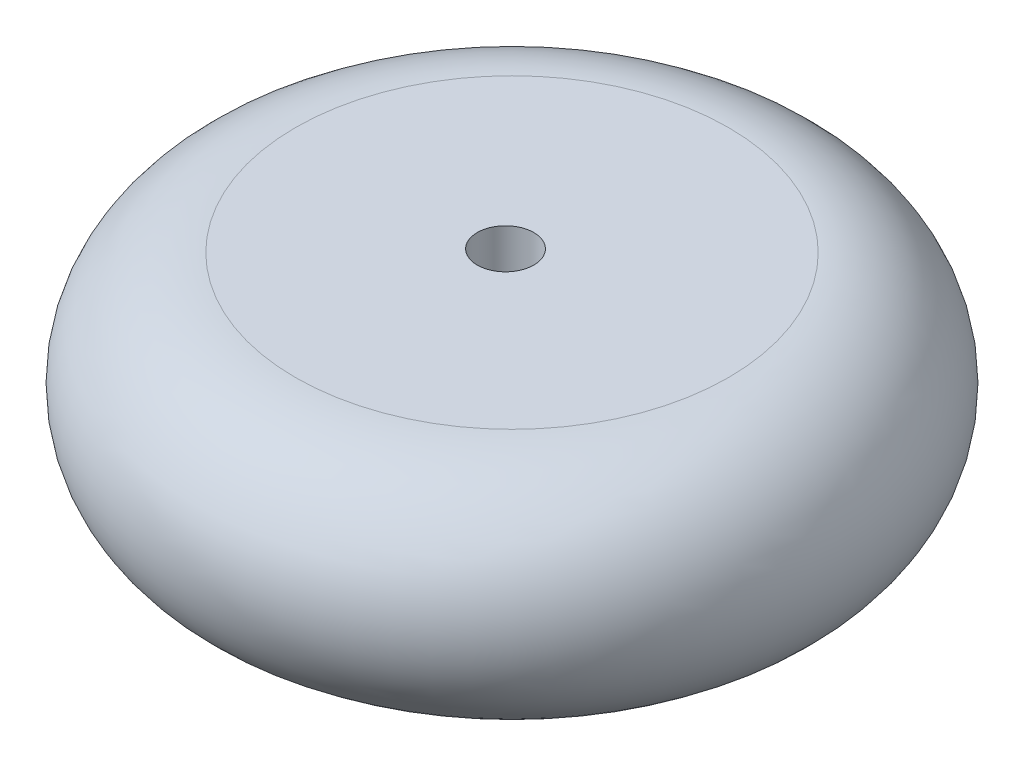
ISO-10303-21;
HEADER;
FILE_DESCRIPTION(('STEP AP214'),'2;1');
FILE_NAME('part.step','',(''),(''),'','','');
FILE_SCHEMA(('AUTOMOTIVE_DESIGN { 1 0 10303 214 1 1 1 1 }'));
ENDSEC;
DATA;
#1=APPLICATION_CONTEXT('core data for automotive mechanical design processes');
#2=APPLICATION_PROTOCOL_DEFINITION('international standard','automotive_design',2000,#1);
#3=PRODUCT_CONTEXT('',#1,'mechanical');
#4=PRODUCT('Part','Part','',(#3));
#5=PRODUCT_RELATED_PRODUCT_CATEGORY('part','',(#4));
#6=PRODUCT_DEFINITION_FORMATION('','',#4);
#7=PRODUCT_DEFINITION_CONTEXT('part definition',#1,'design');
#8=PRODUCT_DEFINITION('design','',#6,#7);
#9=PRODUCT_DEFINITION_SHAPE('','',#8);
#10=(LENGTH_UNIT() NAMED_UNIT(*) SI_UNIT(.MILLI.,.METRE.));
#11=(NAMED_UNIT(*) PLANE_ANGLE_UNIT() SI_UNIT($,.RADIAN.));
#12=(NAMED_UNIT(*) SI_UNIT($,.STERADIAN.) SOLID_ANGLE_UNIT());
#13=UNCERTAINTY_MEASURE_WITH_UNIT(LENGTH_MEASURE(1.E-05),#10,'distance_accuracy_value','');
#14=(GEOMETRIC_REPRESENTATION_CONTEXT(3) GLOBAL_UNCERTAINTY_ASSIGNED_CONTEXT((#13)) GLOBAL_UNIT_ASSIGNED_CONTEXT((#10,
#11,#12)) REPRESENTATION_CONTEXT('',''));
#15=CARTESIAN_POINT('',(0.,0.,0.));
#16=DIRECTION('',(0.,0.,1.));
#17=DIRECTION('',(1.,0.,0.));
#18=AXIS2_PLACEMENT_3D('',#15,#16,#17);
#19=CARTESIAN_POINT('',(13.,0.,0.));
#20=DIRECTION('',(0.,1.,0.));
#21=DIRECTION('',(-1.,0.,0.));
#22=AXIS2_PLACEMENT_3D('',#19,#20,#21);
#23=TOROIDAL_SURFACE('',#22,23.,12.);
#24=CARTESIAN_POINT('',(13.,-12.,0.));
#25=DIRECTION('',(0.,1.,0.));
#26=DIRECTION('',(-1.,0.,0.));
#27=AXIS2_PLACEMENT_3D('',#24,#25,#26);
#28=CIRCLE('',#27,23.);
#29=CARTESIAN_POINT('',(-10.,-12.,0.));
#30=VERTEX_POINT('',#29);
#31=EDGE_CURVE('E10',#30,#30,#28,.T.);
#32=ORIENTED_EDGE('',*,*,#31,.T.);
#33=EDGE_LOOP('',(#32));
#34=FACE_BOUND('',#33,.T.);
#35=CARTESIAN_POINT('',(13.,12.,0.));
#36=DIRECTION('',(0.,1.,0.));
#37=DIRECTION('',(-1.,0.,0.));
#38=AXIS2_PLACEMENT_3D('',#35,#36,#37);
#39=CIRCLE('',#38,23.);
#40=CARTESIAN_POINT('',(-10.,12.,0.));
#41=VERTEX_POINT('',#40);
#42=EDGE_CURVE('E40',#41,#41,#39,.T.);
#43=ORIENTED_EDGE('',*,*,#42,.F.);
#44=EDGE_LOOP('',(#43));
#45=FACE_BOUND('',#44,.T.);
#46=ADVANCED_FACE('F34',(#34,#45),#23,.T.);
#47=CARTESIAN_POINT('',(-10.,-12.,0.));
#48=DIRECTION('',(0.,-1.,0.));
#49=DIRECTION('',(1.,0.,0.));
#50=AXIS2_PLACEMENT_3D('',#47,#48,#49);
#51=PLANE('',#50);
#52=CARTESIAN_POINT('',(12.3108556447744,-12.,0.));
#53=DIRECTION('',(0.,-1.,0.));
#54=DIRECTION('',(1.,0.,0.));
#55=AXIS2_PLACEMENT_3D('',#52,#53,#54);
#56=CIRCLE('',#55,3.);
#57=CARTESIAN_POINT('',(15.3108556447744,-12.,0.));
#58=VERTEX_POINT('',#57);
#59=EDGE_CURVE('E44',#58,#58,#56,.T.);
#60=ORIENTED_EDGE('',*,*,#59,.F.);
#61=EDGE_LOOP('',(#60));
#62=FACE_BOUND('',#61,.T.);
#63=ORIENTED_EDGE('',*,*,#31,.F.);
#64=EDGE_LOOP('',(#63));
#65=FACE_BOUND('',#64,.T.);
#66=ADVANCED_FACE('F62',(#62,#65),#51,.T.);
#67=CARTESIAN_POINT('',(-10.,12.,0.));
#68=DIRECTION('',(0.,1.,0.));
#69=DIRECTION('',(-1.,0.,0.));
#70=AXIS2_PLACEMENT_3D('',#67,#68,#69);
#71=PLANE('',#70);
#72=CARTESIAN_POINT('',(12.3108556447744,12.,0.));
#73=DIRECTION('',(0.,1.,0.));
#74=DIRECTION('',(-1.,0.,0.));
#75=AXIS2_PLACEMENT_3D('',#72,#73,#74);
#76=CIRCLE('',#75,3.);
#77=CARTESIAN_POINT('',(9.31085564477435,12.,0.));
#78=VERTEX_POINT('',#77);
#79=EDGE_CURVE('E48',#78,#78,#76,.F.);
#80=ORIENTED_EDGE('',*,*,#79,.T.);
#81=EDGE_LOOP('',(#80));
#82=FACE_BOUND('',#81,.T.);
#83=ORIENTED_EDGE('',*,*,#42,.T.);
#84=EDGE_LOOP('',(#83));
#85=FACE_BOUND('',#84,.T.);
#86=ADVANCED_FACE('F54',(#82,#85),#71,.T.);
#87=CARTESIAN_POINT('',(12.3108556447744,12.001,0.));
#88=DIRECTION('',(0.,-1.,0.));
#89=DIRECTION('',(1.,0.,0.));
#90=AXIS2_PLACEMENT_3D('',#87,#88,#89);
#91=CYLINDRICAL_SURFACE('',#90,3.);
#92=ORIENTED_EDGE('',*,*,#79,.F.);
#93=EDGE_LOOP('',(#92));
#94=FACE_BOUND('',#93,.T.);
#95=ORIENTED_EDGE('',*,*,#59,.T.);
#96=EDGE_LOOP('',(#95));
#97=FACE_BOUND('',#96,.T.);
#98=ADVANCED_FACE('F56',(#94,#97),#91,.F.);
#99=CLOSED_SHELL('',(#46,#66,#86,#98));
#100=MANIFOLD_SOLID_BREP('B2',#99);
#101=ADVANCED_BREP_SHAPE_REPRESENTATION('',(#18,#100),#14);
#102=SHAPE_DEFINITION_REPRESENTATION(#9,#101);
ENDSEC;
END-ISO-10303-21;
